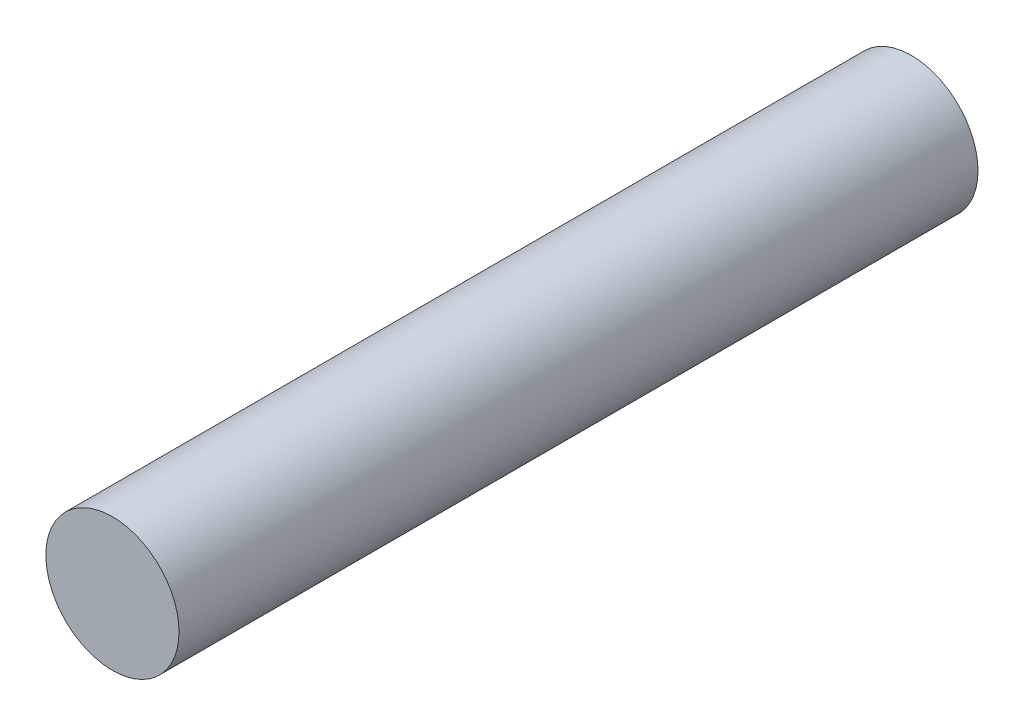
ISO-10303-21;
HEADER;
FILE_DESCRIPTION(('STEP AP214'),'2;1');
FILE_NAME('part.step','',(''),(''),'','','');
FILE_SCHEMA(('AUTOMOTIVE_DESIGN { 1 0 10303 214 1 1 1 1 }'));
ENDSEC;
DATA;
#1=APPLICATION_CONTEXT('core data for automotive mechanical design processes');
#2=APPLICATION_PROTOCOL_DEFINITION('international standard','automotive_design',2000,#1);
#3=PRODUCT_CONTEXT('',#1,'mechanical');
#4=PRODUCT('Part','Part','',(#3));
#5=PRODUCT_RELATED_PRODUCT_CATEGORY('part','',(#4));
#6=PRODUCT_DEFINITION_FORMATION('','',#4);
#7=PRODUCT_DEFINITION_CONTEXT('part definition',#1,'design');
#8=PRODUCT_DEFINITION('design','',#6,#7);
#9=PRODUCT_DEFINITION_SHAPE('','',#8);
#10=(LENGTH_UNIT() NAMED_UNIT(*) SI_UNIT(.MILLI.,.METRE.));
#11=(NAMED_UNIT(*) PLANE_ANGLE_UNIT() SI_UNIT($,.RADIAN.));
#12=(NAMED_UNIT(*) SI_UNIT($,.STERADIAN.) SOLID_ANGLE_UNIT());
#13=UNCERTAINTY_MEASURE_WITH_UNIT(LENGTH_MEASURE(1.E-05),#10,'distance_accuracy_value','');
#14=(GEOMETRIC_REPRESENTATION_CONTEXT(3) GLOBAL_UNCERTAINTY_ASSIGNED_CONTEXT((#13)) GLOBAL_UNIT_ASSIGNED_CONTEXT((#10,
#11,#12)) REPRESENTATION_CONTEXT('',''));
#15=CARTESIAN_POINT('',(0.,0.,0.));
#16=DIRECTION('',(0.,0.,1.));
#17=DIRECTION('',(1.,0.,0.));
#18=AXIS2_PLACEMENT_3D('',#15,#16,#17);
#19=CARTESIAN_POINT('',(0.,0.,76.2));
#20=DIRECTION('',(0.,0.,-1.));
#21=DIRECTION('',(-1.,0.,0.));
#22=AXIS2_PLACEMENT_3D('',#19,#20,#21);
#23=CYLINDRICAL_SURFACE('',#22,6.35);
#24=CARTESIAN_POINT('',(0.,0.,76.2));
#25=DIRECTION('',(0.,0.,1.));
#26=DIRECTION('',(1.,0.,0.));
#27=AXIS2_PLACEMENT_3D('',#24,#25,#26);
#28=CIRCLE('',#27,6.35);
#29=CARTESIAN_POINT('',(6.35,0.,76.2));
#30=VERTEX_POINT('',#29);
#31=EDGE_CURVE('E10',#30,#30,#28,.T.);
#32=ORIENTED_EDGE('',*,*,#31,.F.);
#33=EDGE_LOOP('',(#32));
#34=FACE_BOUND('',#33,.T.);
#35=CARTESIAN_POINT('',(0.,0.,0.));
#36=DIRECTION('',(0.,0.,1.));
#37=DIRECTION('',(1.,0.,0.));
#38=AXIS2_PLACEMENT_3D('',#35,#36,#37);
#39=CIRCLE('',#38,6.35);
#40=CARTESIAN_POINT('',(6.35,0.,0.));
#41=VERTEX_POINT('',#40);
#42=EDGE_CURVE('E34',#41,#41,#39,.T.);
#43=ORIENTED_EDGE('',*,*,#42,.T.);
#44=EDGE_LOOP('',(#43));
#45=FACE_BOUND('',#44,.T.);
#46=ADVANCED_FACE('F31',(#34,#45),#23,.T.);
#47=CARTESIAN_POINT('',(0.,0.,76.2));
#48=DIRECTION('',(0.,0.,1.));
#49=DIRECTION('',(1.,0.,0.));
#50=AXIS2_PLACEMENT_3D('',#47,#48,#49);
#51=PLANE('',#50);
#52=ORIENTED_EDGE('',*,*,#31,.T.);
#53=EDGE_LOOP('',(#52));
#54=FACE_BOUND('',#53,.T.);
#55=ADVANCED_FACE('F46',(#54),#51,.T.);
#56=CARTESIAN_POINT('',(0.,0.,0.));
#57=DIRECTION('',(0.,0.,1.));
#58=DIRECTION('',(1.,0.,0.));
#59=AXIS2_PLACEMENT_3D('',#56,#57,#58);
#60=PLANE('',#59);
#61=ORIENTED_EDGE('',*,*,#42,.F.);
#62=EDGE_LOOP('',(#61));
#63=FACE_BOUND('',#62,.T.);
#64=ADVANCED_FACE('F44',(#63),#60,.F.);
#65=CLOSED_SHELL('',(#46,#55,#64));
#66=MANIFOLD_SOLID_BREP('B2',#65);
#67=ADVANCED_BREP_SHAPE_REPRESENTATION('',(#18,#66),#14);
#68=SHAPE_DEFINITION_REPRESENTATION(#9,#67);
ENDSEC;
END-ISO-10303-21;
